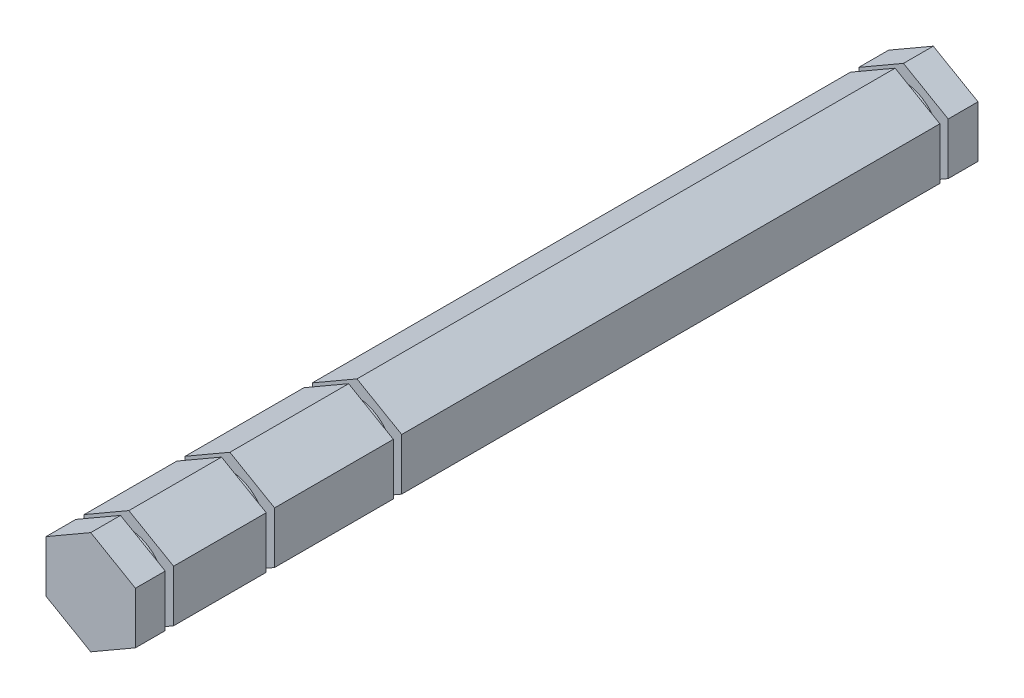
ISO-10303-21;
HEADER;
FILE_DESCRIPTION(('STEP AP214'),'2;1');
FILE_NAME('part.step','',(''),(''),'','','');
FILE_SCHEMA(('AUTOMOTIVE_DESIGN { 1 0 10303 214 1 1 1 1 }'));
ENDSEC;
DATA;
#1=APPLICATION_CONTEXT('core data for automotive mechanical design processes');
#2=APPLICATION_PROTOCOL_DEFINITION('international standard','automotive_design',2000,#1);
#3=PRODUCT_CONTEXT('',#1,'mechanical');
#4=PRODUCT('Part','Part','',(#3));
#5=PRODUCT_RELATED_PRODUCT_CATEGORY('part','',(#4));
#6=PRODUCT_DEFINITION_FORMATION('','',#4);
#7=PRODUCT_DEFINITION_CONTEXT('part definition',#1,'design');
#8=PRODUCT_DEFINITION('design','',#6,#7);
#9=PRODUCT_DEFINITION_SHAPE('','',#8);
#10=(LENGTH_UNIT() NAMED_UNIT(*) SI_UNIT(.MILLI.,.METRE.));
#11=(NAMED_UNIT(*) PLANE_ANGLE_UNIT() SI_UNIT($,.RADIAN.));
#12=(NAMED_UNIT(*) SI_UNIT($,.STERADIAN.) SOLID_ANGLE_UNIT());
#13=UNCERTAINTY_MEASURE_WITH_UNIT(LENGTH_MEASURE(1.E-05),#10,'distance_accuracy_value','');
#14=(GEOMETRIC_REPRESENTATION_CONTEXT(3) GLOBAL_UNCERTAINTY_ASSIGNED_CONTEXT((#13)) GLOBAL_UNIT_ASSIGNED_CONTEXT((#10,
#11,#12)) REPRESENTATION_CONTEXT('',''));
#15=CARTESIAN_POINT('',(0.,0.,0.));
#16=DIRECTION('',(0.,0.,1.));
#17=DIRECTION('',(1.,0.,0.));
#18=AXIS2_PLACEMENT_3D('',#15,#16,#17);
#19=CARTESIAN_POINT('',(4.76249999999996,2.74963065701564,97.3582));
#20=DIRECTION('',(-0.499999999999995,-0.866025403784442,0.));
#21=DIRECTION('',(0.866025403784442,-0.499999999999995,0.));
#22=AXIS2_PLACEMENT_3D('',#19,#20,#21);
#23=PLANE('',#22);
#24=DIRECTION('',(-0.866025403784442,0.499999999999995,0.));
#25=VECTOR('',#24,1.);
#26=CARTESIAN_POINT('',(4.76249999999996,2.74963065701564,93.4212));
#27=LINE('',#26,#25);
#28=CARTESIAN_POINT('',(4.76249999999996,2.74963065701564,93.4212));
#29=VERTEX_POINT('',#28);
#30=CARTESIAN_POINT('',(0.,5.49926131403118,93.4212));
#31=VERTEX_POINT('',#30);
#32=EDGE_CURVE('E227',#29,#31,#27,.T.);
#33=ORIENTED_EDGE('',*,*,#32,.F.);
#34=DIRECTION('',(0.,0.,-1.));
#35=VECTOR('',#34,1.);
#36=CARTESIAN_POINT('',(4.76249999999996,2.74963065701564,97.3582));
#37=LINE('',#36,#35);
#38=CARTESIAN_POINT('',(4.76249999999996,2.74963065701564,90.2462));
#39=VERTEX_POINT('',#38);
#40=EDGE_CURVE('E235',#29,#39,#37,.T.);
#41=ORIENTED_EDGE('',*,*,#40,.T.);
#42=DIRECTION('',(-0.866025403784442,0.499999999999995,0.));
#43=VECTOR('',#42,1.);
#44=CARTESIAN_POINT('',(4.76249999999996,2.74963065701564,90.2462));
#45=LINE('',#44,#43);
#46=CARTESIAN_POINT('',(0.,5.49926131403118,90.2462));
#47=VERTEX_POINT('',#46);
#48=EDGE_CURVE('E397',#39,#47,#45,.T.);
#49=ORIENTED_EDGE('',*,*,#48,.T.);
#50=DIRECTION('',(0.,0.,-1.));
#51=VECTOR('',#50,1.);
#52=CARTESIAN_POINT('',(0.,5.49926131403118,97.3582));
#53=LINE('',#52,#51);
#54=EDGE_CURVE('E237',#31,#47,#53,.T.);
#55=ORIENTED_EDGE('',*,*,#54,.F.);
#56=EDGE_LOOP('',(#33,#41,#49,#55));
#57=FACE_BOUND('',#56,.T.);
#58=ADVANCED_FACE('F32',(#57),#23,.F.);
#59=CARTESIAN_POINT('',(0.,5.49926131403118,97.3582));
#60=DIRECTION('',(0.500000000000001,-0.866025403784438,0.));
#61=DIRECTION('',(0.866025403784438,0.500000000000001,0.));
#62=AXIS2_PLACEMENT_3D('',#59,#60,#61);
#63=PLANE('',#62);
#64=DIRECTION('',(-0.866025403784438,-0.500000000000001,0.));
#65=VECTOR('',#64,1.);
#66=CARTESIAN_POINT('',(0.,5.49926131403118,93.4212));
#67=LINE('',#66,#65);
#68=CARTESIAN_POINT('',(-4.7625,2.74963065701558,93.4212));
#69=VERTEX_POINT('',#68);
#70=EDGE_CURVE('E239',#31,#69,#67,.T.);
#71=ORIENTED_EDGE('',*,*,#70,.F.);
#72=ORIENTED_EDGE('',*,*,#54,.T.);
#73=DIRECTION('',(-0.866025403784438,-0.500000000000001,0.));
#74=VECTOR('',#73,1.);
#75=CARTESIAN_POINT('',(0.,5.49926131403118,90.2462));
#76=LINE('',#75,#74);
#77=CARTESIAN_POINT('',(-4.7625,2.74963065701558,90.2462));
#78=VERTEX_POINT('',#77);
#79=EDGE_CURVE('E295',#47,#78,#76,.T.);
#80=ORIENTED_EDGE('',*,*,#79,.T.);
#81=DIRECTION('',(0.,0.,-1.));
#82=VECTOR('',#81,1.);
#83=CARTESIAN_POINT('',(-4.7625,2.74963065701558,97.3582));
#84=LINE('',#83,#82);
#85=EDGE_CURVE('E473',#69,#78,#84,.T.);
#86=ORIENTED_EDGE('',*,*,#85,.F.);
#87=EDGE_LOOP('',(#71,#72,#80,#86));
#88=FACE_BOUND('',#87,.T.);
#89=ADVANCED_FACE('F559',(#88),#63,.F.);
#90=CARTESIAN_POINT('',(-4.7625,2.74963065701558,97.3582));
#91=DIRECTION('',(1.,0.,0.));
#92=DIRECTION('',(0.,1.,0.));
#93=AXIS2_PLACEMENT_3D('',#90,#91,#92);
#94=PLANE('',#93);
#95=DIRECTION('',(0.,-1.,0.));
#96=VECTOR('',#95,1.);
#97=CARTESIAN_POINT('',(-4.7625,2.74963065701558,93.4212));
#98=LINE('',#97,#96);
#99=CARTESIAN_POINT('',(-4.76249999999998,-2.74963065701561,93.4212));
#100=VERTEX_POINT('',#99);
#101=EDGE_CURVE('E597',#69,#100,#98,.T.);
#102=ORIENTED_EDGE('',*,*,#101,.F.);
#103=ORIENTED_EDGE('',*,*,#85,.T.);
#104=DIRECTION('',(0.,-1.,0.));
#105=VECTOR('',#104,1.);
#106=CARTESIAN_POINT('',(-4.7625,2.74963065701558,90.2462));
#107=LINE('',#106,#105);
#108=CARTESIAN_POINT('',(-4.76249999999998,-2.74963065701561,90.2462));
#109=VERTEX_POINT('',#108);
#110=EDGE_CURVE('E299',#78,#109,#107,.T.);
#111=ORIENTED_EDGE('',*,*,#110,.T.);
#112=DIRECTION('',(0.,0.,-1.));
#113=VECTOR('',#112,1.);
#114=CARTESIAN_POINT('',(-4.76249999999998,-2.74963065701561,97.3582));
#115=LINE('',#114,#113);
#116=EDGE_CURVE('E457',#100,#109,#115,.T.);
#117=ORIENTED_EDGE('',*,*,#116,.F.);
#118=EDGE_LOOP('',(#102,#103,#111,#117));
#119=FACE_BOUND('',#118,.T.);
#120=ADVANCED_FACE('F563',(#119),#94,.F.);
#121=CARTESIAN_POINT('',(-4.76249999999998,-2.74963065701561,97.3582));
#122=DIRECTION('',(0.499999999999995,0.866025403784442,0.));
#123=DIRECTION('',(-0.866025403784442,0.499999999999995,0.));
#124=AXIS2_PLACEMENT_3D('',#121,#122,#123);
#125=PLANE('',#124);
#126=DIRECTION('',(0.866025403784442,-0.499999999999995,0.));
#127=VECTOR('',#126,1.);
#128=CARTESIAN_POINT('',(-4.76249999999998,-2.74963065701561,93.4212));
#129=LINE('',#128,#127);
#130=CARTESIAN_POINT('',(0.,-5.49926131403118,93.4212));
#131=VERTEX_POINT('',#130);
#132=EDGE_CURVE('E598',#100,#131,#129,.T.);
#133=ORIENTED_EDGE('',*,*,#132,.F.);
#134=ORIENTED_EDGE('',*,*,#116,.T.);
#135=DIRECTION('',(0.866025403784442,-0.499999999999995,0.));
#136=VECTOR('',#135,1.);
#137=CARTESIAN_POINT('',(-4.76249999999998,-2.74963065701561,90.2462));
#138=LINE('',#137,#136);
#139=CARTESIAN_POINT('',(0.,-5.49926131403118,90.2462));
#140=VERTEX_POINT('',#139);
#141=EDGE_CURVE('E302',#109,#140,#138,.T.);
#142=ORIENTED_EDGE('',*,*,#141,.T.);
#143=DIRECTION('',(0.,0.,-1.));
#144=VECTOR('',#143,1.);
#145=CARTESIAN_POINT('',(0.,-5.49926131403118,97.3582));
#146=LINE('',#145,#144);
#147=EDGE_CURVE('E459',#131,#140,#146,.T.);
#148=ORIENTED_EDGE('',*,*,#147,.F.);
#149=EDGE_LOOP('',(#133,#134,#142,#148));
#150=FACE_BOUND('',#149,.T.);
#151=ADVANCED_FACE('F696',(#150),#125,.F.);
#152=CARTESIAN_POINT('',(0.,-5.49926131403118,97.3582));
#153=DIRECTION('',(-0.500000000000007,0.866025403784435,0.));
#154=DIRECTION('',(-0.866025403784435,-0.500000000000007,0.));
#155=AXIS2_PLACEMENT_3D('',#152,#153,#154);
#156=PLANE('',#155);
#157=DIRECTION('',(0.866025403784435,0.500000000000007,0.));
#158=VECTOR('',#157,1.);
#159=CARTESIAN_POINT('',(0.,-5.49926131403118,93.4212));
#160=LINE('',#159,#158);
#161=CARTESIAN_POINT('',(4.76250000000002,-2.74963065701554,93.4212));
#162=VERTEX_POINT('',#161);
#163=EDGE_CURVE('E46',#131,#162,#160,.T.);
#164=ORIENTED_EDGE('',*,*,#163,.F.);
#165=ORIENTED_EDGE('',*,*,#147,.T.);
#166=DIRECTION('',(0.866025403784435,0.500000000000007,0.));
#167=VECTOR('',#166,1.);
#168=CARTESIAN_POINT('',(0.,-5.49926131403118,90.2462));
#169=LINE('',#168,#167);
#170=CARTESIAN_POINT('',(4.76250000000002,-2.74963065701554,90.2462));
#171=VERTEX_POINT('',#170);
#172=EDGE_CURVE('E305',#140,#171,#169,.T.);
#173=ORIENTED_EDGE('',*,*,#172,.T.);
#174=DIRECTION('',(0.,0.,-1.));
#175=VECTOR('',#174,1.);
#176=CARTESIAN_POINT('',(4.76250000000002,-2.74963065701554,97.3582));
#177=LINE('',#176,#175);
#178=EDGE_CURVE('E254',#162,#171,#177,.T.);
#179=ORIENTED_EDGE('',*,*,#178,.F.);
#180=EDGE_LOOP('',(#164,#165,#173,#179));
#181=FACE_BOUND('',#180,.T.);
#182=ADVANCED_FACE('F576',(#181),#156,.F.);
#183=CARTESIAN_POINT('',(4.76250000000002,-2.74963065701554,97.3582));
#184=DIRECTION('',(-1.,0.,0.));
#185=DIRECTION('',(0.,-1.,0.));
#186=AXIS2_PLACEMENT_3D('',#183,#184,#185);
#187=PLANE('',#186);
#188=DIRECTION('',(0.,1.,0.));
#189=VECTOR('',#188,1.);
#190=CARTESIAN_POINT('',(4.76250000000002,-2.74963065701554,93.4212));
#191=LINE('',#190,#189);
#192=EDGE_CURVE('E11',#162,#29,#191,.T.);
#193=ORIENTED_EDGE('',*,*,#192,.F.);
#194=ORIENTED_EDGE('',*,*,#178,.T.);
#195=DIRECTION('',(0.,1.,0.));
#196=VECTOR('',#195,1.);
#197=CARTESIAN_POINT('',(4.76250000000002,-2.74963065701554,90.2462));
#198=LINE('',#197,#196);
#199=EDGE_CURVE('E244',#171,#39,#198,.T.);
#200=ORIENTED_EDGE('',*,*,#199,.T.);
#201=ORIENTED_EDGE('',*,*,#40,.F.);
#202=EDGE_LOOP('',(#193,#194,#200,#201));
#203=FACE_BOUND('',#202,.T.);
#204=ADVANCED_FACE('F242',(#203),#187,.F.);
#205=DIRECTION('',(0.866025403784442,-0.499999999999995,0.));
#206=VECTOR('',#205,1.);
#207=CARTESIAN_POINT('',(4.76249999999996,2.74963065701564,3.68300000000001));
#208=LINE('',#207,#206);
#209=CARTESIAN_POINT('',(0.,5.49926131403118,3.68300000000001));
#210=VERTEX_POINT('',#209);
#211=CARTESIAN_POINT('',(4.76249999999996,2.74963065701564,3.68300000000001));
#212=VERTEX_POINT('',#211);
#213=EDGE_CURVE('E54',#210,#212,#208,.T.);
#214=ORIENTED_EDGE('',*,*,#213,.F.);
#215=CARTESIAN_POINT('',(0.,5.49926131403118,6.858));
#216=VERTEX_POINT('',#215);
#217=EDGE_CURVE('E480',#216,#210,#53,.T.);
#218=ORIENTED_EDGE('',*,*,#217,.F.);
#219=DIRECTION('',(0.866025403784442,-0.499999999999995,0.));
#220=VECTOR('',#219,1.);
#221=CARTESIAN_POINT('',(4.76249999999996,2.74963065701564,6.858));
#222=LINE('',#221,#220);
#223=CARTESIAN_POINT('',(4.76249999999996,2.74963065701564,6.858));
#224=VERTEX_POINT('',#223);
#225=EDGE_CURVE('E406',#216,#224,#222,.T.);
#226=ORIENTED_EDGE('',*,*,#225,.T.);
#227=EDGE_CURVE('E248',#224,#212,#37,.T.);
#228=ORIENTED_EDGE('',*,*,#227,.T.);
#229=EDGE_LOOP('',(#214,#218,#226,#228));
#230=FACE_BOUND('',#229,.T.);
#231=ADVANCED_FACE('F34',(#230),#23,.F.);
#232=DIRECTION('',(0.866025403784438,0.500000000000001,0.));
#233=VECTOR('',#232,1.);
#234=CARTESIAN_POINT('',(0.,5.49926131403118,3.68300000000001));
#235=LINE('',#234,#233);
#236=CARTESIAN_POINT('',(-4.7625,2.74963065701558,3.68300000000001));
#237=VERTEX_POINT('',#236);
#238=EDGE_CURVE('E607',#237,#210,#235,.T.);
#239=ORIENTED_EDGE('',*,*,#238,.F.);
#240=CARTESIAN_POINT('',(-4.7625,2.74963065701558,6.858));
#241=VERTEX_POINT('',#240);
#242=EDGE_CURVE('E466',#241,#237,#84,.T.);
#243=ORIENTED_EDGE('',*,*,#242,.F.);
#244=DIRECTION('',(0.866025403784438,0.500000000000001,0.));
#245=VECTOR('',#244,1.);
#246=CARTESIAN_POINT('',(0.,5.49926131403118,6.858));
#247=LINE('',#246,#245);
#248=EDGE_CURVE('E614',#241,#216,#247,.T.);
#249=ORIENTED_EDGE('',*,*,#248,.T.);
#250=ORIENTED_EDGE('',*,*,#217,.T.);
#251=EDGE_LOOP('',(#239,#243,#249,#250));
#252=FACE_BOUND('',#251,.T.);
#253=ADVANCED_FACE('F566',(#252),#63,.F.);
#254=DIRECTION('',(0.,1.,0.));
#255=VECTOR('',#254,1.);
#256=CARTESIAN_POINT('',(-4.7625,2.74963065701558,3.68300000000001));
#257=LINE('',#256,#255);
#258=CARTESIAN_POINT('',(-4.76249999999998,-2.74963065701561,3.68300000000001));
#259=VERTEX_POINT('',#258);
#260=EDGE_CURVE('E605',#259,#237,#257,.T.);
#261=ORIENTED_EDGE('',*,*,#260,.F.);
#262=CARTESIAN_POINT('',(-4.76249999999998,-2.74963065701561,6.858));
#263=VERTEX_POINT('',#262);
#264=EDGE_CURVE('E453',#263,#259,#115,.T.);
#265=ORIENTED_EDGE('',*,*,#264,.F.);
#266=DIRECTION('',(0.,1.,0.));
#267=VECTOR('',#266,1.);
#268=CARTESIAN_POINT('',(-4.7625,2.74963065701558,6.858));
#269=LINE('',#268,#267);
#270=EDGE_CURVE('E619',#263,#241,#269,.T.);
#271=ORIENTED_EDGE('',*,*,#270,.T.);
#272=ORIENTED_EDGE('',*,*,#242,.T.);
#273=EDGE_LOOP('',(#261,#265,#271,#272));
#274=FACE_BOUND('',#273,.T.);
#275=ADVANCED_FACE('F574',(#274),#94,.F.);
#276=DIRECTION('',(-0.866025403784442,0.499999999999995,0.));
#277=VECTOR('',#276,1.);
#278=CARTESIAN_POINT('',(-4.76249999999998,-2.74963065701561,3.68300000000001));
#279=LINE('',#278,#277);
#280=CARTESIAN_POINT('',(0.,-5.49926131403118,3.68300000000001));
#281=VERTEX_POINT('',#280);
#282=EDGE_CURVE('E421',#281,#259,#279,.T.);
#283=ORIENTED_EDGE('',*,*,#282,.F.);
#284=CARTESIAN_POINT('',(0.,-5.49926131403118,6.858));
#285=VERTEX_POINT('',#284);
#286=EDGE_CURVE('E420',#285,#281,#146,.T.);
#287=ORIENTED_EDGE('',*,*,#286,.F.);
#288=DIRECTION('',(-0.866025403784442,0.499999999999995,0.));
#289=VECTOR('',#288,1.);
#290=CARTESIAN_POINT('',(-4.76249999999998,-2.74963065701561,6.858));
#291=LINE('',#290,#289);
#292=EDGE_CURVE('E432',#285,#263,#291,.T.);
#293=ORIENTED_EDGE('',*,*,#292,.T.);
#294=ORIENTED_EDGE('',*,*,#264,.T.);
#295=EDGE_LOOP('',(#283,#287,#293,#294));
#296=FACE_BOUND('',#295,.T.);
#297=ADVANCED_FACE('F623',(#296),#125,.F.);
#298=DIRECTION('',(-0.866025403784435,-0.500000000000007,0.));
#299=VECTOR('',#298,1.);
#300=CARTESIAN_POINT('',(0.,-5.49926131403118,3.68300000000001));
#301=LINE('',#300,#299);
#302=CARTESIAN_POINT('',(4.76250000000002,-2.74963065701554,3.68300000000001));
#303=VERTEX_POINT('',#302);
#304=EDGE_CURVE('E238',#303,#281,#301,.T.);
#305=ORIENTED_EDGE('',*,*,#304,.F.);
#306=CARTESIAN_POINT('',(4.76250000000002,-2.74963065701554,6.858));
#307=VERTEX_POINT('',#306);
#308=EDGE_CURVE('E245',#307,#303,#177,.T.);
#309=ORIENTED_EDGE('',*,*,#308,.F.);
#310=DIRECTION('',(-0.866025403784435,-0.500000000000007,0.));
#311=VECTOR('',#310,1.);
#312=CARTESIAN_POINT('',(0.,-5.49926131403118,6.858));
#313=LINE('',#312,#311);
#314=EDGE_CURVE('E428',#307,#285,#313,.T.);
#315=ORIENTED_EDGE('',*,*,#314,.T.);
#316=ORIENTED_EDGE('',*,*,#286,.T.);
#317=EDGE_LOOP('',(#305,#309,#315,#316));
#318=FACE_BOUND('',#317,.T.);
#319=ADVANCED_FACE('F417',(#318),#156,.F.);
#320=DIRECTION('',(0.,-1.,0.));
#321=VECTOR('',#320,1.);
#322=CARTESIAN_POINT('',(4.76250000000002,-2.74963065701554,3.68300000000001));
#323=LINE('',#322,#321);
#324=EDGE_CURVE('E40',#212,#303,#323,.T.);
#325=ORIENTED_EDGE('',*,*,#324,.F.);
#326=ORIENTED_EDGE('',*,*,#227,.F.);
#327=DIRECTION('',(0.,-1.,0.));
#328=VECTOR('',#327,1.);
#329=CARTESIAN_POINT('',(4.76250000000002,-2.74963065701554,6.858));
#330=LINE('',#329,#328);
#331=EDGE_CURVE('E425',#224,#307,#330,.T.);
#332=ORIENTED_EDGE('',*,*,#331,.T.);
#333=ORIENTED_EDGE('',*,*,#308,.T.);
#334=EDGE_LOOP('',(#325,#326,#332,#333));
#335=FACE_BOUND('',#334,.T.);
#336=ADVANCED_FACE('F424',(#335),#187,.F.);
#337=DIRECTION('',(0.,-1.,0.));
#338=VECTOR('',#337,1.);
#339=CARTESIAN_POINT('',(4.76250000000002,-2.74963065701554,7.747));
#340=LINE('',#339,#338);
#341=CARTESIAN_POINT('',(4.76249999999996,2.74963065701564,7.747));
#342=VERTEX_POINT('',#341);
#343=CARTESIAN_POINT('',(4.76250000000002,-2.74963065701554,7.747));
#344=VERTEX_POINT('',#343);
#345=EDGE_CURVE('E281',#342,#344,#340,.T.);
#346=ORIENTED_EDGE('',*,*,#345,.F.);
#347=CARTESIAN_POINT('',(4.76249999999996,2.74963065701564,65.0621));
#348=VERTEX_POINT('',#347);
#349=EDGE_CURVE('E255',#348,#342,#37,.T.);
#350=ORIENTED_EDGE('',*,*,#349,.F.);
#351=DIRECTION('',(0.,-1.,0.));
#352=VECTOR('',#351,1.);
#353=CARTESIAN_POINT('',(4.76250000000002,-2.74963065701554,65.0621));
#354=LINE('',#353,#352);
#355=CARTESIAN_POINT('',(4.76250000000002,-2.74963065701554,65.0621));
#356=VERTEX_POINT('',#355);
#357=EDGE_CURVE('E279',#348,#356,#354,.T.);
#358=ORIENTED_EDGE('',*,*,#357,.T.);
#359=EDGE_CURVE('E251',#356,#344,#177,.T.);
#360=ORIENTED_EDGE('',*,*,#359,.T.);
#361=EDGE_LOOP('',(#346,#350,#358,#360));
#362=FACE_BOUND('',#361,.T.);
#363=ADVANCED_FACE('F277',(#362),#187,.F.);
#364=DIRECTION('',(-0.866025403784435,-0.500000000000007,0.));
#365=VECTOR('',#364,1.);
#366=CARTESIAN_POINT('',(0.,-5.49926131403118,7.747));
#367=LINE('',#366,#365);
#368=CARTESIAN_POINT('',(0.,-5.49926131403118,7.747));
#369=VERTEX_POINT('',#368);
#370=EDGE_CURVE('E285',#344,#369,#367,.T.);
#371=ORIENTED_EDGE('',*,*,#370,.F.);
#372=ORIENTED_EDGE('',*,*,#359,.F.);
#373=DIRECTION('',(-0.866025403784435,-0.500000000000007,0.));
#374=VECTOR('',#373,1.);
#375=CARTESIAN_POINT('',(0.,-5.49926131403118,65.0621));
#376=LINE('',#375,#374);
#377=CARTESIAN_POINT('',(0.,-5.49926131403118,65.0621));
#378=VERTEX_POINT('',#377);
#379=EDGE_CURVE('E335',#356,#378,#376,.T.);
#380=ORIENTED_EDGE('',*,*,#379,.T.);
#381=EDGE_CURVE('E507',#378,#369,#146,.T.);
#382=ORIENTED_EDGE('',*,*,#381,.T.);
#383=EDGE_LOOP('',(#371,#372,#380,#382));
#384=FACE_BOUND('',#383,.T.);
#385=ADVANCED_FACE('F752',(#384),#156,.F.);
#386=DIRECTION('',(-0.866025403784442,0.499999999999995,0.));
#387=VECTOR('',#386,1.);
#388=CARTESIAN_POINT('',(-4.76249999999998,-2.74963065701561,7.747));
#389=LINE('',#388,#387);
#390=CARTESIAN_POINT('',(-4.76249999999998,-2.74963065701561,7.747));
#391=VERTEX_POINT('',#390);
#392=EDGE_CURVE('E290',#369,#391,#389,.T.);
#393=ORIENTED_EDGE('',*,*,#392,.F.);
#394=ORIENTED_EDGE('',*,*,#381,.F.);
#395=DIRECTION('',(-0.866025403784442,0.499999999999995,0.));
#396=VECTOR('',#395,1.);
#397=CARTESIAN_POINT('',(-4.76249999999998,-2.74963065701561,65.0621));
#398=LINE('',#397,#396);
#399=CARTESIAN_POINT('',(-4.76249999999998,-2.74963065701561,65.0621));
#400=VERTEX_POINT('',#399);
#401=EDGE_CURVE('E338',#378,#400,#398,.T.);
#402=ORIENTED_EDGE('',*,*,#401,.T.);
#403=EDGE_CURVE('E448',#400,#391,#115,.T.);
#404=ORIENTED_EDGE('',*,*,#403,.T.);
#405=EDGE_LOOP('',(#393,#394,#402,#404));
#406=FACE_BOUND('',#405,.T.);
#407=ADVANCED_FACE('F451',(#406),#125,.F.);
#408=DIRECTION('',(0.,1.,0.));
#409=VECTOR('',#408,1.);
#410=CARTESIAN_POINT('',(-4.7625,2.74963065701558,7.747));
#411=LINE('',#410,#409);
#412=CARTESIAN_POINT('',(-4.7625,2.74963065701558,7.747));
#413=VERTEX_POINT('',#412);
#414=EDGE_CURVE('E430',#391,#413,#411,.T.);
#415=ORIENTED_EDGE('',*,*,#414,.F.);
#416=ORIENTED_EDGE('',*,*,#403,.F.);
#417=DIRECTION('',(0.,1.,0.));
#418=VECTOR('',#417,1.);
#419=CARTESIAN_POINT('',(-4.7625,2.74963065701558,65.0621));
#420=LINE('',#419,#418);
#421=CARTESIAN_POINT('',(-4.7625,2.74963065701558,65.0621));
#422=VERTEX_POINT('',#421);
#423=EDGE_CURVE('E341',#400,#422,#420,.T.);
#424=ORIENTED_EDGE('',*,*,#423,.T.);
#425=EDGE_CURVE('E450',#422,#413,#84,.T.);
#426=ORIENTED_EDGE('',*,*,#425,.T.);
#427=EDGE_LOOP('',(#415,#416,#424,#426));
#428=FACE_BOUND('',#427,.T.);
#429=ADVANCED_FACE('F447',(#428),#94,.F.);
#430=DIRECTION('',(0.866025403784438,0.500000000000001,0.));
#431=VECTOR('',#430,1.);
#432=CARTESIAN_POINT('',(0.,5.49926131403118,7.747));
#433=LINE('',#432,#431);
#434=CARTESIAN_POINT('',(0.,5.49926131403118,7.747));
#435=VERTEX_POINT('',#434);
#436=EDGE_CURVE('E427',#413,#435,#433,.T.);
#437=ORIENTED_EDGE('',*,*,#436,.F.);
#438=ORIENTED_EDGE('',*,*,#425,.F.);
#439=DIRECTION('',(0.866025403784438,0.500000000000001,0.));
#440=VECTOR('',#439,1.);
#441=CARTESIAN_POINT('',(0.,5.49926131403118,65.0621));
#442=LINE('',#441,#440);
#443=CARTESIAN_POINT('',(0.,5.49926131403118,65.0621));
#444=VERTEX_POINT('',#443);
#445=EDGE_CURVE('E344',#422,#444,#442,.T.);
#446=ORIENTED_EDGE('',*,*,#445,.T.);
#447=EDGE_CURVE('E486',#444,#435,#53,.T.);
#448=ORIENTED_EDGE('',*,*,#447,.T.);
#449=EDGE_LOOP('',(#437,#438,#446,#448));
#450=FACE_BOUND('',#449,.T.);
#451=ADVANCED_FACE('F565',(#450),#63,.F.);
#452=DIRECTION('',(0.866025403784442,-0.499999999999995,0.));
#453=VECTOR('',#452,1.);
#454=CARTESIAN_POINT('',(4.76249999999996,2.74963065701564,7.747));
#455=LINE('',#454,#453);
#456=EDGE_CURVE('E271',#435,#342,#455,.T.);
#457=ORIENTED_EDGE('',*,*,#456,.F.);
#458=ORIENTED_EDGE('',*,*,#447,.F.);
#459=DIRECTION('',(0.866025403784442,-0.499999999999995,0.));
#460=VECTOR('',#459,1.);
#461=CARTESIAN_POINT('',(4.76249999999996,2.74963065701564,65.0621));
#462=LINE('',#461,#460);
#463=EDGE_CURVE('E273',#444,#348,#462,.T.);
#464=ORIENTED_EDGE('',*,*,#463,.T.);
#465=ORIENTED_EDGE('',*,*,#349,.T.);
#466=EDGE_LOOP('',(#457,#458,#464,#465));
#467=FACE_BOUND('',#466,.T.);
#468=ADVANCED_FACE('F269',(#467),#23,.F.);
#469=DIRECTION('',(0.,1.,0.));
#470=VECTOR('',#469,1.);
#471=CARTESIAN_POINT('',(4.76250000000002,-2.74963065701554,89.3572));
#472=LINE('',#471,#470);
#473=CARTESIAN_POINT('',(4.76250000000002,-2.74963065701554,89.3572));
#474=VERTEX_POINT('',#473);
#475=CARTESIAN_POINT('',(4.76249999999996,2.74963065701564,89.3572));
#476=VERTEX_POINT('',#475);
#477=EDGE_CURVE('E317',#474,#476,#472,.T.);
#478=ORIENTED_EDGE('',*,*,#477,.F.);
#479=CARTESIAN_POINT('',(4.76250000000002,-2.74963065701554,79.4893));
#480=VERTEX_POINT('',#479);
#481=EDGE_CURVE('E253',#474,#480,#177,.T.);
#482=ORIENTED_EDGE('',*,*,#481,.T.);
#483=DIRECTION('',(0.,-1.,0.));
#484=VECTOR('',#483,1.);
#485=CARTESIAN_POINT('',(4.76250000000002,-2.74963065701554,79.4893));
#486=LINE('',#485,#484);
#487=CARTESIAN_POINT('',(4.76249999999996,2.74963065701564,79.4893));
#488=VERTEX_POINT('',#487);
#489=EDGE_CURVE('E399',#488,#480,#486,.T.);
#490=ORIENTED_EDGE('',*,*,#489,.F.);
#491=EDGE_CURVE('E246',#476,#488,#37,.T.);
#492=ORIENTED_EDGE('',*,*,#491,.F.);
#493=EDGE_LOOP('',(#478,#482,#490,#492));
#494=FACE_BOUND('',#493,.T.);
#495=ADVANCED_FACE('F516',(#494),#187,.F.);
#496=DIRECTION('',(0.866025403784435,0.500000000000007,0.));
#497=VECTOR('',#496,1.);
#498=CARTESIAN_POINT('',(0.,-5.49926131403118,89.3572));
#499=LINE('',#498,#497);
#500=CARTESIAN_POINT('',(0.,-5.49926131403118,89.3572));
#501=VERTEX_POINT('',#500);
#502=EDGE_CURVE('E315',#501,#474,#499,.T.);
#503=ORIENTED_EDGE('',*,*,#502,.F.);
#504=CARTESIAN_POINT('',(0.,-5.49926131403118,79.4893));
#505=VERTEX_POINT('',#504);
#506=EDGE_CURVE('E506',#501,#505,#146,.T.);
#507=ORIENTED_EDGE('',*,*,#506,.T.);
#508=DIRECTION('',(-0.866025403784435,-0.500000000000007,0.));
#509=VECTOR('',#508,1.);
#510=CARTESIAN_POINT('',(0.,-5.49926131403118,79.4893));
#511=LINE('',#510,#509);
#512=EDGE_CURVE('E352',#480,#505,#511,.T.);
#513=ORIENTED_EDGE('',*,*,#512,.F.);
#514=ORIENTED_EDGE('',*,*,#481,.F.);
#515=EDGE_LOOP('',(#503,#507,#513,#514));
#516=FACE_BOUND('',#515,.T.);
#517=ADVANCED_FACE('F524',(#516),#156,.F.);
#518=DIRECTION('',(0.866025403784442,-0.499999999999995,0.));
#519=VECTOR('',#518,1.);
#520=CARTESIAN_POINT('',(-4.76249999999998,-2.74963065701561,89.3572));
#521=LINE('',#520,#519);
#522=CARTESIAN_POINT('',(-4.76249999999998,-2.74963065701561,89.3572));
#523=VERTEX_POINT('',#522);
#524=EDGE_CURVE('E313',#523,#501,#521,.T.);
#525=ORIENTED_EDGE('',*,*,#524,.F.);
#526=CARTESIAN_POINT('',(-4.76249999999998,-2.74963065701561,79.4893));
#527=VERTEX_POINT('',#526);
#528=EDGE_CURVE('E455',#523,#527,#115,.T.);
#529=ORIENTED_EDGE('',*,*,#528,.T.);
#530=DIRECTION('',(-0.866025403784442,0.499999999999995,0.));
#531=VECTOR('',#530,1.);
#532=CARTESIAN_POINT('',(-4.76249999999998,-2.74963065701561,79.4893));
#533=LINE('',#532,#531);
#534=EDGE_CURVE('E357',#505,#527,#533,.T.);
#535=ORIENTED_EDGE('',*,*,#534,.F.);
#536=ORIENTED_EDGE('',*,*,#506,.F.);
#537=EDGE_LOOP('',(#525,#529,#535,#536));
#538=FACE_BOUND('',#537,.T.);
#539=ADVANCED_FACE('F526',(#538),#125,.F.);
#540=DIRECTION('',(0.,-1.,0.));
#541=VECTOR('',#540,1.);
#542=CARTESIAN_POINT('',(-4.7625,2.74963065701558,89.3572));
#543=LINE('',#542,#541);
#544=CARTESIAN_POINT('',(-4.7625,2.74963065701558,89.3572));
#545=VERTEX_POINT('',#544);
#546=EDGE_CURVE('E311',#545,#523,#543,.T.);
#547=ORIENTED_EDGE('',*,*,#546,.F.);
#548=CARTESIAN_POINT('',(-4.7625,2.74963065701558,79.4893));
#549=VERTEX_POINT('',#548);
#550=EDGE_CURVE('E472',#545,#549,#84,.T.);
#551=ORIENTED_EDGE('',*,*,#550,.T.);
#552=DIRECTION('',(0.,1.,0.));
#553=VECTOR('',#552,1.);
#554=CARTESIAN_POINT('',(-4.7625,2.74963065701558,79.4893));
#555=LINE('',#554,#553);
#556=EDGE_CURVE('E360',#527,#549,#555,.T.);
#557=ORIENTED_EDGE('',*,*,#556,.F.);
#558=ORIENTED_EDGE('',*,*,#528,.F.);
#559=EDGE_LOOP('',(#547,#551,#557,#558));
#560=FACE_BOUND('',#559,.T.);
#561=ADVANCED_FACE('F531',(#560),#94,.F.);
#562=DIRECTION('',(-0.866025403784438,-0.500000000000001,0.));
#563=VECTOR('',#562,1.);
#564=CARTESIAN_POINT('',(0.,5.49926131403118,89.3572));
#565=LINE('',#564,#563);
#566=CARTESIAN_POINT('',(0.,5.49926131403118,89.3572));
#567=VERTEX_POINT('',#566);
#568=EDGE_CURVE('E309',#567,#545,#565,.T.);
#569=ORIENTED_EDGE('',*,*,#568,.F.);
#570=CARTESIAN_POINT('',(0.,5.49926131403118,79.4893));
#571=VERTEX_POINT('',#570);
#572=EDGE_CURVE('E487',#567,#571,#53,.T.);
#573=ORIENTED_EDGE('',*,*,#572,.T.);
#574=DIRECTION('',(0.866025403784438,0.500000000000001,0.));
#575=VECTOR('',#574,1.);
#576=CARTESIAN_POINT('',(0.,5.49926131403118,79.4893));
#577=LINE('',#576,#575);
#578=EDGE_CURVE('E363',#549,#571,#577,.T.);
#579=ORIENTED_EDGE('',*,*,#578,.F.);
#580=ORIENTED_EDGE('',*,*,#550,.F.);
#581=EDGE_LOOP('',(#569,#573,#579,#580));
#582=FACE_BOUND('',#581,.T.);
#583=ADVANCED_FACE('F535',(#582),#63,.F.);
#584=DIRECTION('',(-0.866025403784442,0.499999999999995,0.));
#585=VECTOR('',#584,1.);
#586=CARTESIAN_POINT('',(4.76249999999996,2.74963065701564,89.3572));
#587=LINE('',#586,#585);
#588=EDGE_CURVE('E404',#476,#567,#587,.T.);
#589=ORIENTED_EDGE('',*,*,#588,.F.);
#590=ORIENTED_EDGE('',*,*,#491,.T.);
#591=DIRECTION('',(0.866025403784442,-0.499999999999995,0.));
#592=VECTOR('',#591,1.);
#593=CARTESIAN_POINT('',(4.76249999999996,2.74963065701564,79.4893));
#594=LINE('',#593,#592);
#595=EDGE_CURVE('E366',#571,#488,#594,.T.);
#596=ORIENTED_EDGE('',*,*,#595,.F.);
#597=ORIENTED_EDGE('',*,*,#572,.F.);
#598=EDGE_LOOP('',(#589,#590,#596,#597));
#599=FACE_BOUND('',#598,.T.);
#600=ADVANCED_FACE('F539',(#599),#23,.F.);
#601=DIRECTION('',(0.866025403784442,-0.499999999999995,0.));
#602=VECTOR('',#601,1.);
#603=CARTESIAN_POINT('',(4.76249999999996,2.74963065701564,65.9511));
#604=LINE('',#603,#602);
#605=CARTESIAN_POINT('',(0.,5.49926131403118,65.9511));
#606=VERTEX_POINT('',#605);
#607=CARTESIAN_POINT('',(4.76249999999996,2.74963065701564,65.9511));
#608=VERTEX_POINT('',#607);
#609=EDGE_CURVE('E333',#606,#608,#604,.T.);
#610=ORIENTED_EDGE('',*,*,#609,.F.);
#611=CARTESIAN_POINT('',(0.,5.49926131403118,78.6003));
#612=VERTEX_POINT('',#611);
#613=EDGE_CURVE('E383',#612,#606,#53,.T.);
#614=ORIENTED_EDGE('',*,*,#613,.F.);
#615=DIRECTION('',(0.866025403784442,-0.499999999999995,0.));
#616=VECTOR('',#615,1.);
#617=CARTESIAN_POINT('',(4.76249999999996,2.74963065701564,78.6003));
#618=LINE('',#617,#616);
#619=CARTESIAN_POINT('',(4.76249999999996,2.74963065701564,78.6003));
#620=VERTEX_POINT('',#619);
#621=EDGE_CURVE('E258',#612,#620,#618,.T.);
#622=ORIENTED_EDGE('',*,*,#621,.T.);
#623=EDGE_CURVE('E249',#620,#608,#37,.T.);
#624=ORIENTED_EDGE('',*,*,#623,.T.);
#625=EDGE_LOOP('',(#610,#614,#622,#624));
#626=FACE_BOUND('',#625,.T.);
#627=ADVANCED_FACE('F381',(#626),#23,.F.);
#628=DIRECTION('',(0.866025403784438,0.500000000000001,0.));
#629=VECTOR('',#628,1.);
#630=CARTESIAN_POINT('',(0.,5.49926131403118,65.9511));
#631=LINE('',#630,#629);
#632=CARTESIAN_POINT('',(-4.7625,2.74963065701558,65.9511));
#633=VERTEX_POINT('',#632);
#634=EDGE_CURVE('E331',#633,#606,#631,.T.);
#635=ORIENTED_EDGE('',*,*,#634,.F.);
#636=CARTESIAN_POINT('',(-4.7625,2.74963065701558,78.6003));
#637=VERTEX_POINT('',#636);
#638=EDGE_CURVE('E478',#637,#633,#84,.T.);
#639=ORIENTED_EDGE('',*,*,#638,.F.);
#640=DIRECTION('',(0.866025403784438,0.500000000000001,0.));
#641=VECTOR('',#640,1.);
#642=CARTESIAN_POINT('',(0.,5.49926131403118,78.6003));
#643=LINE('',#642,#641);
#644=EDGE_CURVE('E378',#637,#612,#643,.T.);
#645=ORIENTED_EDGE('',*,*,#644,.T.);
#646=ORIENTED_EDGE('',*,*,#613,.T.);
#647=EDGE_LOOP('',(#635,#639,#645,#646));
#648=FACE_BOUND('',#647,.T.);
#649=ADVANCED_FACE('F496',(#648),#63,.F.);
#650=DIRECTION('',(0.,1.,0.));
#651=VECTOR('',#650,1.);
#652=CARTESIAN_POINT('',(-4.7625,2.74963065701558,65.9511));
#653=LINE('',#652,#651);
#654=CARTESIAN_POINT('',(-4.76249999999998,-2.74963065701561,65.9511));
#655=VERTEX_POINT('',#654);
#656=EDGE_CURVE('E329',#655,#633,#653,.T.);
#657=ORIENTED_EDGE('',*,*,#656,.F.);
#658=CARTESIAN_POINT('',(-4.76249999999998,-2.74963065701561,78.6003));
#659=VERTEX_POINT('',#658);
#660=EDGE_CURVE('E452',#659,#655,#115,.T.);
#661=ORIENTED_EDGE('',*,*,#660,.F.);
#662=DIRECTION('',(0.,1.,0.));
#663=VECTOR('',#662,1.);
#664=CARTESIAN_POINT('',(-4.7625,2.74963065701558,78.6003));
#665=LINE('',#664,#663);
#666=EDGE_CURVE('E375',#659,#637,#665,.T.);
#667=ORIENTED_EDGE('',*,*,#666,.T.);
#668=ORIENTED_EDGE('',*,*,#638,.T.);
#669=EDGE_LOOP('',(#657,#661,#667,#668));
#670=FACE_BOUND('',#669,.T.);
#671=ADVANCED_FACE('F492',(#670),#94,.F.);
#672=DIRECTION('',(-0.866025403784442,0.499999999999995,0.));
#673=VECTOR('',#672,1.);
#674=CARTESIAN_POINT('',(-4.76249999999998,-2.74963065701561,65.9511));
#675=LINE('',#674,#673);
#676=CARTESIAN_POINT('',(0.,-5.49926131403118,65.9511));
#677=VERTEX_POINT('',#676);
#678=EDGE_CURVE('E327',#677,#655,#675,.T.);
#679=ORIENTED_EDGE('',*,*,#678,.F.);
#680=CARTESIAN_POINT('',(0.,-5.49926131403118,78.6003));
#681=VERTEX_POINT('',#680);
#682=EDGE_CURVE('E503',#681,#677,#146,.T.);
#683=ORIENTED_EDGE('',*,*,#682,.F.);
#684=DIRECTION('',(-0.866025403784442,0.499999999999995,0.));
#685=VECTOR('',#684,1.);
#686=CARTESIAN_POINT('',(-4.76249999999998,-2.74963065701561,78.6003));
#687=LINE('',#686,#685);
#688=EDGE_CURVE('E372',#681,#659,#687,.T.);
#689=ORIENTED_EDGE('',*,*,#688,.T.);
#690=ORIENTED_EDGE('',*,*,#660,.T.);
#691=EDGE_LOOP('',(#679,#683,#689,#690));
#692=FACE_BOUND('',#691,.T.);
#693=ADVANCED_FACE('F502',(#692),#125,.F.);
#694=DIRECTION('',(-0.866025403784435,-0.500000000000007,0.));
#695=VECTOR('',#694,1.);
#696=CARTESIAN_POINT('',(0.,-5.49926131403118,65.9511));
#697=LINE('',#696,#695);
#698=CARTESIAN_POINT('',(4.76250000000002,-2.74963065701554,65.9511));
#699=VERTEX_POINT('',#698);
#700=EDGE_CURVE('E323',#699,#677,#697,.T.);
#701=ORIENTED_EDGE('',*,*,#700,.F.);
#702=CARTESIAN_POINT('',(4.76250000000002,-2.74963065701554,78.6003));
#703=VERTEX_POINT('',#702);
#704=EDGE_CURVE('E393',#703,#699,#177,.T.);
#705=ORIENTED_EDGE('',*,*,#704,.F.);
#706=DIRECTION('',(-0.866025403784435,-0.500000000000007,0.));
#707=VECTOR('',#706,1.);
#708=CARTESIAN_POINT('',(0.,-5.49926131403118,78.6003));
#709=LINE('',#708,#707);
#710=EDGE_CURVE('E369',#703,#681,#709,.T.);
#711=ORIENTED_EDGE('',*,*,#710,.T.);
#712=ORIENTED_EDGE('',*,*,#682,.T.);
#713=EDGE_LOOP('',(#701,#705,#711,#712));
#714=FACE_BOUND('',#713,.T.);
#715=ADVANCED_FACE('F505',(#714),#156,.F.);
#716=DIRECTION('',(0.,-1.,0.));
#717=VECTOR('',#716,1.);
#718=CARTESIAN_POINT('',(4.76250000000002,-2.74963065701554,65.9511));
#719=LINE('',#718,#717);
#720=EDGE_CURVE('E392',#608,#699,#719,.T.);
#721=ORIENTED_EDGE('',*,*,#720,.F.);
#722=ORIENTED_EDGE('',*,*,#623,.F.);
#723=DIRECTION('',(0.,-1.,0.));
#724=VECTOR('',#723,1.);
#725=CARTESIAN_POINT('',(4.76250000000002,-2.74963065701554,78.6003));
#726=LINE('',#725,#724);
#727=EDGE_CURVE('E390',#620,#703,#726,.T.);
#728=ORIENTED_EDGE('',*,*,#727,.T.);
#729=ORIENTED_EDGE('',*,*,#704,.T.);
#730=EDGE_LOOP('',(#721,#722,#728,#729));
#731=FACE_BOUND('',#730,.T.);
#732=ADVANCED_FACE('F388',(#731),#187,.F.);
#733=CARTESIAN_POINT('',(0.,0.,78.6003));
#734=DIRECTION('',(0.,0.,-1.));
#735=DIRECTION('',(-1.,0.,0.));
#736=AXIS2_PLACEMENT_3D('',#733,#734,#735);
#737=PLANE('',#736);
#738=CARTESIAN_POINT('',(0.,0.,78.6003));
#739=DIRECTION('',(0.,0.,1.));
#740=DIRECTION('',(1.,0.,0.));
#741=AXIS2_PLACEMENT_3D('',#738,#739,#740);
#742=CIRCLE('',#741,3.8481);
#743=CARTESIAN_POINT('',(3.8481,0.,78.6003));
#744=VERTEX_POINT('',#743);
#745=EDGE_CURVE('E349',#744,#744,#742,.T.);
#746=ORIENTED_EDGE('',*,*,#745,.F.);
#747=EDGE_LOOP('',(#746));
#748=FACE_BOUND('',#747,.T.);
#749=ORIENTED_EDGE('',*,*,#644,.F.);
#750=ORIENTED_EDGE('',*,*,#666,.F.);
#751=ORIENTED_EDGE('',*,*,#688,.F.);
#752=ORIENTED_EDGE('',*,*,#710,.F.);
#753=ORIENTED_EDGE('',*,*,#727,.F.);
#754=ORIENTED_EDGE('',*,*,#621,.F.);
#755=EDGE_LOOP('',(#749,#750,#751,#752,#753,#754));
#756=FACE_BOUND('',#755,.T.);
#757=ADVANCED_FACE('F781',(#748,#756),#737,.F.);
#758=CARTESIAN_POINT('',(0.,0.,79.4893));
#759=DIRECTION('',(0.,0.,-1.));
#760=DIRECTION('',(-1.,0.,0.));
#761=AXIS2_PLACEMENT_3D('',#758,#759,#760);
#762=PLANE('',#761);
#763=CARTESIAN_POINT('',(0.,0.,79.4893));
#764=DIRECTION('',(0.,0.,1.));
#765=DIRECTION('',(1.,0.,0.));
#766=AXIS2_PLACEMENT_3D('',#763,#764,#765);
#767=CIRCLE('',#766,3.8481);
#768=CARTESIAN_POINT('',(3.8481,0.,79.4893));
#769=VERTEX_POINT('',#768);
#770=EDGE_CURVE('E348',#769,#769,#767,.T.);
#771=ORIENTED_EDGE('',*,*,#770,.T.);
#772=EDGE_LOOP('',(#771));
#773=FACE_BOUND('',#772,.T.);
#774=ORIENTED_EDGE('',*,*,#595,.T.);
#775=ORIENTED_EDGE('',*,*,#489,.T.);
#776=ORIENTED_EDGE('',*,*,#512,.T.);
#777=ORIENTED_EDGE('',*,*,#534,.T.);
#778=ORIENTED_EDGE('',*,*,#556,.T.);
#779=ORIENTED_EDGE('',*,*,#578,.T.);
#780=EDGE_LOOP('',(#774,#775,#776,#777,#778,#779));
#781=FACE_BOUND('',#780,.T.);
#782=ADVANCED_FACE('F522',(#773,#781),#762,.T.);
#783=CARTESIAN_POINT('',(0.,0.,78.6003));
#784=DIRECTION('',(0.,0.,1.));
#785=DIRECTION('',(1.,0.,0.));
#786=AXIS2_PLACEMENT_3D('',#783,#784,#785);
#787=CYLINDRICAL_SURFACE('',#786,3.8481);
#788=ORIENTED_EDGE('',*,*,#745,.T.);
#789=EDGE_LOOP('',(#788));
#790=FACE_BOUND('',#789,.T.);
#791=ORIENTED_EDGE('',*,*,#770,.F.);
#792=EDGE_LOOP('',(#791));
#793=FACE_BOUND('',#792,.T.);
#794=ADVANCED_FACE('F801',(#790,#793),#787,.T.);
#795=CARTESIAN_POINT('',(0.,0.,65.0621));
#796=DIRECTION('',(0.,0.,-1.));
#797=DIRECTION('',(-1.,0.,0.));
#798=AXIS2_PLACEMENT_3D('',#795,#796,#797);
#799=PLANE('',#798);
#800=CARTESIAN_POINT('',(0.,0.,65.0621));
#801=DIRECTION('',(0.,0.,1.));
#802=DIRECTION('',(1.,0.,0.));
#803=AXIS2_PLACEMENT_3D('',#800,#801,#802);
#804=CIRCLE('',#803,3.8481);
#805=CARTESIAN_POINT('',(3.8481,0.,65.0621));
#806=VERTEX_POINT('',#805);
#807=EDGE_CURVE('E320',#806,#806,#804,.T.);
#808=ORIENTED_EDGE('',*,*,#807,.F.);
#809=EDGE_LOOP('',(#808));
#810=FACE_BOUND('',#809,.T.);
#811=ORIENTED_EDGE('',*,*,#445,.F.);
#812=ORIENTED_EDGE('',*,*,#423,.F.);
#813=ORIENTED_EDGE('',*,*,#401,.F.);
#814=ORIENTED_EDGE('',*,*,#379,.F.);
#815=ORIENTED_EDGE('',*,*,#357,.F.);
#816=ORIENTED_EDGE('',*,*,#463,.F.);
#817=EDGE_LOOP('',(#811,#812,#813,#814,#815,#816));
#818=FACE_BOUND('',#817,.T.);
#819=ADVANCED_FACE('F806',(#810,#818),#799,.F.);
#820=CARTESIAN_POINT('',(0.,0.,65.9511));
#821=DIRECTION('',(0.,0.,-1.));
#822=DIRECTION('',(-1.,0.,0.));
#823=AXIS2_PLACEMENT_3D('',#820,#821,#822);
#824=PLANE('',#823);
#825=CARTESIAN_POINT('',(0.,0.,65.9511));
#826=DIRECTION('',(0.,0.,1.));
#827=DIRECTION('',(1.,0.,0.));
#828=AXIS2_PLACEMENT_3D('',#825,#826,#827);
#829=CIRCLE('',#828,3.8481);
#830=CARTESIAN_POINT('',(3.8481,0.,65.9511));
#831=VERTEX_POINT('',#830);
#832=EDGE_CURVE('E319',#831,#831,#829,.T.);
#833=ORIENTED_EDGE('',*,*,#832,.T.);
#834=EDGE_LOOP('',(#833));
#835=FACE_BOUND('',#834,.T.);
#836=ORIENTED_EDGE('',*,*,#609,.T.);
#837=ORIENTED_EDGE('',*,*,#720,.T.);
#838=ORIENTED_EDGE('',*,*,#700,.T.);
#839=ORIENTED_EDGE('',*,*,#678,.T.);
#840=ORIENTED_EDGE('',*,*,#656,.T.);
#841=ORIENTED_EDGE('',*,*,#634,.T.);
#842=EDGE_LOOP('',(#836,#837,#838,#839,#840,#841));
#843=FACE_BOUND('',#842,.T.);
#844=ADVANCED_FACE('F497',(#835,#843),#824,.T.);
#845=CARTESIAN_POINT('',(0.,0.,65.0621));
#846=DIRECTION('',(0.,0.,1.));
#847=DIRECTION('',(1.,0.,0.));
#848=AXIS2_PLACEMENT_3D('',#845,#846,#847);
#849=CYLINDRICAL_SURFACE('',#848,3.8481);
#850=ORIENTED_EDGE('',*,*,#807,.T.);
#851=EDGE_LOOP('',(#850));
#852=FACE_BOUND('',#851,.T.);
#853=ORIENTED_EDGE('',*,*,#832,.F.);
#854=EDGE_LOOP('',(#853));
#855=FACE_BOUND('',#854,.T.);
#856=ADVANCED_FACE('F544',(#852,#855),#849,.T.);
#857=CARTESIAN_POINT('',(0.,0.,89.3572));
#858=DIRECTION('',(0.,0.,1.));
#859=DIRECTION('',(1.,0.,0.));
#860=AXIS2_PLACEMENT_3D('',#857,#858,#859);
#861=PLANE('',#860);
#862=CARTESIAN_POINT('',(0.,0.,89.3572));
#863=DIRECTION('',(0.,0.,1.));
#864=DIRECTION('',(1.,0.,0.));
#865=AXIS2_PLACEMENT_3D('',#862,#863,#864);
#866=CIRCLE('',#865,3.8481);
#867=CARTESIAN_POINT('',(3.8481,0.,89.3572));
#868=VERTEX_POINT('',#867);
#869=EDGE_CURVE('E288',#868,#868,#866,.T.);
#870=ORIENTED_EDGE('',*,*,#869,.F.);
#871=EDGE_LOOP('',(#870));
#872=FACE_BOUND('',#871,.T.);
#873=ORIENTED_EDGE('',*,*,#477,.T.);
#874=ORIENTED_EDGE('',*,*,#588,.T.);
#875=ORIENTED_EDGE('',*,*,#568,.T.);
#876=ORIENTED_EDGE('',*,*,#546,.T.);
#877=ORIENTED_EDGE('',*,*,#524,.T.);
#878=ORIENTED_EDGE('',*,*,#502,.T.);
#879=EDGE_LOOP('',(#873,#874,#875,#876,#877,#878));
#880=FACE_BOUND('',#879,.T.);
#881=ADVANCED_FACE('F541',(#872,#880),#861,.T.);
#882=CARTESIAN_POINT('',(0.,0.,90.2462));
#883=DIRECTION('',(0.,0.,1.));
#884=DIRECTION('',(1.,0.,0.));
#885=AXIS2_PLACEMENT_3D('',#882,#883,#884);
#886=PLANE('',#885);
#887=CARTESIAN_POINT('',(0.,0.,90.2462));
#888=DIRECTION('',(0.,0.,1.));
#889=DIRECTION('',(1.,0.,0.));
#890=AXIS2_PLACEMENT_3D('',#887,#888,#889);
#891=CIRCLE('',#890,3.8481);
#892=CARTESIAN_POINT('',(3.8481,0.,90.2462));
#893=VERTEX_POINT('',#892);
#894=EDGE_CURVE('E284',#893,#893,#891,.T.);
#895=ORIENTED_EDGE('',*,*,#894,.T.);
#896=EDGE_LOOP('',(#895));
#897=FACE_BOUND('',#896,.T.);
#898=ORIENTED_EDGE('',*,*,#172,.F.);
#899=ORIENTED_EDGE('',*,*,#141,.F.);
#900=ORIENTED_EDGE('',*,*,#110,.F.);
#901=ORIENTED_EDGE('',*,*,#79,.F.);
#902=ORIENTED_EDGE('',*,*,#48,.F.);
#903=ORIENTED_EDGE('',*,*,#199,.F.);
#904=EDGE_LOOP('',(#898,#899,#900,#901,#902,#903));
#905=FACE_BOUND('',#904,.T.);
#906=ADVANCED_FACE('F543',(#897,#905),#886,.F.);
#907=CARTESIAN_POINT('',(0.,0.,89.3572));
#908=DIRECTION('',(0.,0.,1.));
#909=DIRECTION('',(1.,0.,0.));
#910=AXIS2_PLACEMENT_3D('',#907,#908,#909);
#911=CYLINDRICAL_SURFACE('',#910,3.8481);
#912=ORIENTED_EDGE('',*,*,#869,.T.);
#913=EDGE_LOOP('',(#912));
#914=FACE_BOUND('',#913,.T.);
#915=ORIENTED_EDGE('',*,*,#894,.F.);
#916=EDGE_LOOP('',(#915));
#917=FACE_BOUND('',#916,.T.);
#918=ADVANCED_FACE('F551',(#914,#917),#911,.T.);
#919=CARTESIAN_POINT('',(0.,0.,7.747));
#920=DIRECTION('',(0.,0.,-1.));
#921=DIRECTION('',(-1.,0.,0.));
#922=AXIS2_PLACEMENT_3D('',#919,#920,#921);
#923=PLANE('',#922);
#924=CARTESIAN_POINT('',(0.,0.,7.747));
#925=DIRECTION('',(0.,0.,-1.));
#926=DIRECTION('',(-1.,0.,0.));
#927=AXIS2_PLACEMENT_3D('',#924,#925,#926);
#928=CIRCLE('',#927,3.8481);
#929=CARTESIAN_POINT('',(-3.8481,0.,7.747));
#930=VERTEX_POINT('',#929);
#931=EDGE_CURVE('E611',#930,#930,#928,.T.);
#932=ORIENTED_EDGE('',*,*,#931,.F.);
#933=EDGE_LOOP('',(#932));
#934=FACE_BOUND('',#933,.T.);
#935=ORIENTED_EDGE('',*,*,#345,.T.);
#936=ORIENTED_EDGE('',*,*,#370,.T.);
#937=ORIENTED_EDGE('',*,*,#392,.T.);
#938=ORIENTED_EDGE('',*,*,#414,.T.);
#939=ORIENTED_EDGE('',*,*,#436,.T.);
#940=ORIENTED_EDGE('',*,*,#456,.T.);
#941=EDGE_LOOP('',(#935,#936,#937,#938,#939,#940));
#942=FACE_BOUND('',#941,.T.);
#943=ADVANCED_FACE('F438',(#934,#942),#923,.T.);
#944=CARTESIAN_POINT('',(0.,0.,6.858));
#945=DIRECTION('',(0.,0.,-1.));
#946=DIRECTION('',(-1.,0.,0.));
#947=AXIS2_PLACEMENT_3D('',#944,#945,#946);
#948=PLANE('',#947);
#949=CARTESIAN_POINT('',(0.,0.,6.858));
#950=DIRECTION('',(0.,0.,-1.));
#951=DIRECTION('',(-1.,0.,0.));
#952=AXIS2_PLACEMENT_3D('',#949,#950,#951);
#953=CIRCLE('',#952,3.8481);
#954=CARTESIAN_POINT('',(-3.8481,0.,6.858));
#955=VERTEX_POINT('',#954);
#956=EDGE_CURVE('E610',#955,#955,#953,.T.);
#957=ORIENTED_EDGE('',*,*,#956,.T.);
#958=EDGE_LOOP('',(#957));
#959=FACE_BOUND('',#958,.T.);
#960=ORIENTED_EDGE('',*,*,#225,.F.);
#961=ORIENTED_EDGE('',*,*,#248,.F.);
#962=ORIENTED_EDGE('',*,*,#270,.F.);
#963=ORIENTED_EDGE('',*,*,#292,.F.);
#964=ORIENTED_EDGE('',*,*,#314,.F.);
#965=ORIENTED_EDGE('',*,*,#331,.F.);
#966=EDGE_LOOP('',(#960,#961,#962,#963,#964,#965));
#967=FACE_BOUND('',#966,.T.);
#968=ADVANCED_FACE('F626',(#959,#967),#948,.F.);
#969=CARTESIAN_POINT('',(0.,0.,7.747));
#970=DIRECTION('',(0.,0.,-1.));
#971=DIRECTION('',(-1.,0.,0.));
#972=AXIS2_PLACEMENT_3D('',#969,#970,#971);
#973=CYLINDRICAL_SURFACE('',#972,3.8481);
#974=ORIENTED_EDGE('',*,*,#931,.T.);
#975=EDGE_LOOP('',(#974));
#976=FACE_BOUND('',#975,.T.);
#977=ORIENTED_EDGE('',*,*,#956,.F.);
#978=EDGE_LOOP('',(#977));
#979=FACE_BOUND('',#978,.T.);
#980=ADVANCED_FACE('F628',(#976,#979),#973,.T.);
#981=CARTESIAN_POINT('',(0.,0.,3.683));
#982=DIRECTION('',(0.,0.,-1.));
#983=DIRECTION('',(-1.,0.,0.));
#984=AXIS2_PLACEMENT_3D('',#981,#982,#983);
#985=PLANE('',#984);
#986=ORIENTED_EDGE('',*,*,#213,.T.);
#987=ORIENTED_EDGE('',*,*,#324,.T.);
#988=ORIENTED_EDGE('',*,*,#304,.T.);
#989=ORIENTED_EDGE('',*,*,#282,.T.);
#990=ORIENTED_EDGE('',*,*,#260,.T.);
#991=ORIENTED_EDGE('',*,*,#238,.T.);
#992=EDGE_LOOP('',(#986,#987,#988,#989,#990,#991));
#993=FACE_BOUND('',#992,.T.);
#994=ADVANCED_FACE('F410',(#993),#985,.T.);
#995=CARTESIAN_POINT('',(0.,0.,93.4212));
#996=DIRECTION('',(0.,0.,1.));
#997=DIRECTION('',(1.,0.,0.));
#998=AXIS2_PLACEMENT_3D('',#995,#996,#997);
#999=PLANE('',#998);
#1000=ORIENTED_EDGE('',*,*,#32,.T.);
#1001=ORIENTED_EDGE('',*,*,#70,.T.);
#1002=ORIENTED_EDGE('',*,*,#101,.T.);
#1003=ORIENTED_EDGE('',*,*,#132,.T.);
#1004=ORIENTED_EDGE('',*,*,#163,.T.);
#1005=ORIENTED_EDGE('',*,*,#192,.T.);
#1006=EDGE_LOOP('',(#1000,#1001,#1002,#1003,#1004,#1005));
#1007=FACE_BOUND('',#1006,.T.);
#1008=ADVANCED_FACE('F226',(#1007),#999,.T.);
#1009=CLOSED_SHELL('',(#58,#89,#120,#151,#182,#204,#231,#253,#275,#297,#319,#336,#363,#385,#407,
#429,#451,#468,#495,#517,#539,#561,#583,#600,#627,#649,#671,#693,#715,#732,#757,#782,#794,#819,
#844,#856,#881,#906,#918,#943,#968,#980,#994,#1008));
#1010=MANIFOLD_SOLID_BREP('B2',#1009);
#1011=ADVANCED_BREP_SHAPE_REPRESENTATION('',(#18,#1010),#14);
#1012=SHAPE_DEFINITION_REPRESENTATION(#9,#1011);
ENDSEC;
END-ISO-10303-21;
